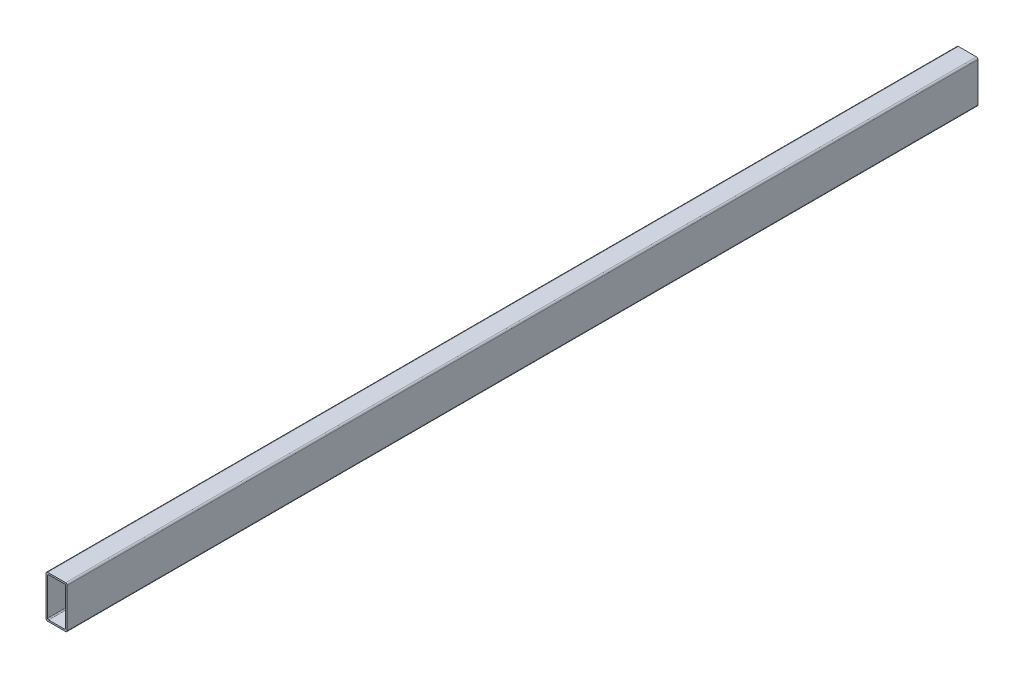
ISO-10303-21;
HEADER;
FILE_DESCRIPTION(('STEP AP214'),'2;1');
FILE_NAME('part.step','',(''),(''),'','','');
FILE_SCHEMA(('AUTOMOTIVE_DESIGN { 1 0 10303 214 1 1 1 1 }'));
ENDSEC;
DATA;
#1=APPLICATION_CONTEXT('core data for automotive mechanical design processes');
#2=APPLICATION_PROTOCOL_DEFINITION('international standard','automotive_design',2000,#1);
#3=PRODUCT_CONTEXT('',#1,'mechanical');
#4=PRODUCT('Part','Part','',(#3));
#5=PRODUCT_RELATED_PRODUCT_CATEGORY('part','',(#4));
#6=PRODUCT_DEFINITION_FORMATION('','',#4);
#7=PRODUCT_DEFINITION_CONTEXT('part definition',#1,'design');
#8=PRODUCT_DEFINITION('design','',#6,#7);
#9=PRODUCT_DEFINITION_SHAPE('','',#8);
#10=(LENGTH_UNIT() NAMED_UNIT(*) SI_UNIT(.MILLI.,.METRE.));
#11=(NAMED_UNIT(*) PLANE_ANGLE_UNIT() SI_UNIT($,.RADIAN.));
#12=(NAMED_UNIT(*) SI_UNIT($,.STERADIAN.) SOLID_ANGLE_UNIT());
#13=UNCERTAINTY_MEASURE_WITH_UNIT(LENGTH_MEASURE(1.E-05),#10,'distance_accuracy_value','');
#14=(GEOMETRIC_REPRESENTATION_CONTEXT(3) GLOBAL_UNCERTAINTY_ASSIGNED_CONTEXT((#13)) GLOBAL_UNIT_ASSIGNED_CONTEXT((#10,
#11,#12)) REPRESENTATION_CONTEXT('',''));
#15=CARTESIAN_POINT('',(0.,0.,0.));
#16=DIRECTION('',(0.,0.,1.));
#17=DIRECTION('',(1.,0.,0.));
#18=AXIS2_PLACEMENT_3D('',#15,#16,#17);
#19=CARTESIAN_POINT('',(0.,38.4999999999987,474.721359549994));
#20=DIRECTION('',(-1.,0.,0.));
#21=DIRECTION('',(0.,-1.,0.));
#22=AXIS2_PLACEMENT_3D('',#19,#20,#21);
#23=PLANE('',#22);
#24=DIRECTION('',(0.,1.,0.));
#25=VECTOR('',#24,1.);
#26=CARTESIAN_POINT('',(0.,38.4999999999987,429.999999999998));
#27=LINE('',#26,#25);
#28=CARTESIAN_POINT('',(0.,1.49999999999872,429.999999999998));
#29=VERTEX_POINT('',#28);
#30=CARTESIAN_POINT('',(0.,38.4999999999987,429.999999999998));
#31=VERTEX_POINT('',#30);
#32=EDGE_CURVE('E196',#29,#31,#27,.T.);
#33=ORIENTED_EDGE('',*,*,#32,.F.);
#34=DIRECTION('',(0.,0.,-1.));
#35=VECTOR('',#34,1.);
#36=CARTESIAN_POINT('',(0.,1.49999999999872,474.721359549994));
#37=LINE('',#36,#35);
#38=CARTESIAN_POINT('',(0.,1.49999999999872,-429.999999999998));
#39=VERTEX_POINT('',#38);
#40=EDGE_CURVE('E49',#29,#39,#37,.T.);
#41=ORIENTED_EDGE('',*,*,#40,.T.);
#42=DIRECTION('',(0.,1.,0.));
#43=VECTOR('',#42,1.);
#44=CARTESIAN_POINT('',(0.,38.4999999999987,-429.999999999998));
#45=LINE('',#44,#43);
#46=CARTESIAN_POINT('',(0.,38.4999999999987,-429.999999999998));
#47=VERTEX_POINT('',#46);
#48=EDGE_CURVE('E272',#39,#47,#45,.T.);
#49=ORIENTED_EDGE('',*,*,#48,.T.);
#50=DIRECTION('',(0.,0.,-1.));
#51=VECTOR('',#50,1.);
#52=CARTESIAN_POINT('',(0.,38.4999999999987,474.721359549994));
#53=LINE('',#52,#51);
#54=EDGE_CURVE('E232',#31,#47,#53,.T.);
#55=ORIENTED_EDGE('',*,*,#54,.F.);
#56=EDGE_LOOP('',(#33,#41,#49,#55));
#57=FACE_BOUND('',#56,.T.);
#58=ADVANCED_FACE('F34',(#57),#23,.F.);
#59=CARTESIAN_POINT('',(-1.50000000000001,1.49999999999872,474.721359549994));
#60=DIRECTION('',(0.,0.,-1.));
#61=DIRECTION('',(-1.,0.,0.));
#62=AXIS2_PLACEMENT_3D('',#59,#60,#61);
#63=CYLINDRICAL_SURFACE('',#62,1.5);
#64=CARTESIAN_POINT('',(-1.50000000000001,1.49999999999872,429.999999999998));
#65=DIRECTION('',(0.,0.,1.));
#66=DIRECTION('',(1.,0.,0.));
#67=AXIS2_PLACEMENT_3D('',#64,#65,#66);
#68=CIRCLE('',#67,1.5);
#69=CARTESIAN_POINT('',(-1.50000000000003,-1.27675647831893E-12,429.999999999998));
#70=VERTEX_POINT('',#69);
#71=EDGE_CURVE('E199',#70,#29,#68,.T.);
#72=ORIENTED_EDGE('',*,*,#71,.F.);
#73=DIRECTION('',(0.,0.,-1.));
#74=VECTOR('',#73,1.);
#75=CARTESIAN_POINT('',(-1.50000000000003,-1.27675647831893E-12,474.721359549994));
#76=LINE('',#75,#74);
#77=CARTESIAN_POINT('',(-1.50000000000003,-1.27675647831893E-12,-429.999999999998));
#78=VERTEX_POINT('',#77);
#79=EDGE_CURVE('E235',#70,#78,#76,.T.);
#80=ORIENTED_EDGE('',*,*,#79,.T.);
#81=CARTESIAN_POINT('',(-1.50000000000001,1.49999999999872,-429.999999999998));
#82=DIRECTION('',(0.,0.,1.));
#83=DIRECTION('',(1.,0.,0.));
#84=AXIS2_PLACEMENT_3D('',#81,#82,#83);
#85=CIRCLE('',#84,1.5);
#86=EDGE_CURVE('E270',#78,#39,#85,.T.);
#87=ORIENTED_EDGE('',*,*,#86,.T.);
#88=ORIENTED_EDGE('',*,*,#40,.F.);
#89=EDGE_LOOP('',(#72,#80,#87,#88));
#90=FACE_BOUND('',#89,.T.);
#91=ADVANCED_FACE('F320',(#90),#63,.T.);
#92=CARTESIAN_POINT('',(-18.5,-1.27675647831893E-12,474.721359549994));
#93=DIRECTION('',(0.,1.,0.));
#94=DIRECTION('',(0.,0.,1.));
#95=AXIS2_PLACEMENT_3D('',#92,#93,#94);
#96=PLANE('',#95);
#97=DIRECTION('',(1.,0.,0.));
#98=VECTOR('',#97,1.);
#99=CARTESIAN_POINT('',(-18.5,-1.27675647831893E-12,429.999999999998));
#100=LINE('',#99,#98);
#101=CARTESIAN_POINT('',(-18.5,-1.27675647831893E-12,429.999999999998));
#102=VERTEX_POINT('',#101);
#103=EDGE_CURVE('E202',#102,#70,#100,.T.);
#104=ORIENTED_EDGE('',*,*,#103,.F.);
#105=DIRECTION('',(0.,0.,-1.));
#106=VECTOR('',#105,1.);
#107=CARTESIAN_POINT('',(-18.5,-1.27675647831893E-12,474.721359549994));
#108=LINE('',#107,#106);
#109=CARTESIAN_POINT('',(-18.5,-1.27675647831893E-12,-429.999999999998));
#110=VERTEX_POINT('',#109);
#111=EDGE_CURVE('E237',#102,#110,#108,.T.);
#112=ORIENTED_EDGE('',*,*,#111,.T.);
#113=DIRECTION('',(1.,0.,0.));
#114=VECTOR('',#113,1.);
#115=CARTESIAN_POINT('',(-18.5,-1.27675647831893E-12,-429.999999999998));
#116=LINE('',#115,#114);
#117=EDGE_CURVE('E267',#110,#78,#116,.T.);
#118=ORIENTED_EDGE('',*,*,#117,.T.);
#119=ORIENTED_EDGE('',*,*,#79,.F.);
#120=EDGE_LOOP('',(#104,#112,#118,#119));
#121=FACE_BOUND('',#120,.T.);
#122=ADVANCED_FACE('F325',(#121),#96,.F.);
#123=CARTESIAN_POINT('',(-18.5,1.49999999999872,474.721359549994));
#124=DIRECTION('',(0.,0.,-1.));
#125=DIRECTION('',(-1.,0.,0.));
#126=AXIS2_PLACEMENT_3D('',#123,#124,#125);
#127=CYLINDRICAL_SURFACE('',#126,1.5);
#128=CARTESIAN_POINT('',(-18.5,1.49999999999872,429.999999999998));
#129=DIRECTION('',(0.,0.,1.));
#130=DIRECTION('',(1.,0.,0.));
#131=AXIS2_PLACEMENT_3D('',#128,#129,#130);
#132=CIRCLE('',#131,1.5);
#133=CARTESIAN_POINT('',(-20.,1.49999999999872,429.999999999998));
#134=VERTEX_POINT('',#133);
#135=EDGE_CURVE('E205',#134,#102,#132,.T.);
#136=ORIENTED_EDGE('',*,*,#135,.F.);
#137=DIRECTION('',(0.,0.,-1.));
#138=VECTOR('',#137,1.);
#139=CARTESIAN_POINT('',(-20.,1.49999999999872,474.721359549994));
#140=LINE('',#139,#138);
#141=CARTESIAN_POINT('',(-20.,1.49999999999872,-429.999999999998));
#142=VERTEX_POINT('',#141);
#143=EDGE_CURVE('E239',#134,#142,#140,.T.);
#144=ORIENTED_EDGE('',*,*,#143,.T.);
#145=CARTESIAN_POINT('',(-18.5,1.49999999999872,-429.999999999998));
#146=DIRECTION('',(0.,0.,1.));
#147=DIRECTION('',(1.,0.,0.));
#148=AXIS2_PLACEMENT_3D('',#145,#146,#147);
#149=CIRCLE('',#148,1.5);
#150=EDGE_CURVE('E264',#142,#110,#149,.T.);
#151=ORIENTED_EDGE('',*,*,#150,.T.);
#152=ORIENTED_EDGE('',*,*,#111,.F.);
#153=EDGE_LOOP('',(#136,#144,#151,#152));
#154=FACE_BOUND('',#153,.T.);
#155=ADVANCED_FACE('F330',(#154),#127,.T.);
#156=CARTESIAN_POINT('',(-20.,38.4999999999987,474.721359549994));
#157=DIRECTION('',(1.,0.,0.));
#158=DIRECTION('',(0.,1.,0.));
#159=AXIS2_PLACEMENT_3D('',#156,#157,#158);
#160=PLANE('',#159);
#161=DIRECTION('',(0.,-1.,0.));
#162=VECTOR('',#161,1.);
#163=CARTESIAN_POINT('',(-20.,38.4999999999987,429.999999999998));
#164=LINE('',#163,#162);
#165=CARTESIAN_POINT('',(-20.,38.4999999999987,429.999999999998));
#166=VERTEX_POINT('',#165);
#167=EDGE_CURVE('E208',#166,#134,#164,.T.);
#168=ORIENTED_EDGE('',*,*,#167,.F.);
#169=DIRECTION('',(0.,0.,-1.));
#170=VECTOR('',#169,1.);
#171=CARTESIAN_POINT('',(-20.,38.4999999999987,474.721359549994));
#172=LINE('',#171,#170);
#173=CARTESIAN_POINT('',(-20.,38.4999999999987,-429.999999999998));
#174=VERTEX_POINT('',#173);
#175=EDGE_CURVE('E241',#166,#174,#172,.T.);
#176=ORIENTED_EDGE('',*,*,#175,.T.);
#177=DIRECTION('',(0.,-1.,0.));
#178=VECTOR('',#177,1.);
#179=CARTESIAN_POINT('',(-20.,38.4999999999987,-429.999999999998));
#180=LINE('',#179,#178);
#181=EDGE_CURVE('E259',#174,#142,#180,.T.);
#182=ORIENTED_EDGE('',*,*,#181,.T.);
#183=ORIENTED_EDGE('',*,*,#143,.F.);
#184=EDGE_LOOP('',(#168,#176,#182,#183));
#185=FACE_BOUND('',#184,.T.);
#186=ADVANCED_FACE('F334',(#185),#160,.F.);
#187=CARTESIAN_POINT('',(-18.5,38.4999999999987,474.721359549994));
#188=DIRECTION('',(0.,0.,-1.));
#189=DIRECTION('',(-1.,0.,0.));
#190=AXIS2_PLACEMENT_3D('',#187,#188,#189);
#191=CYLINDRICAL_SURFACE('',#190,1.50000000000001);
#192=CARTESIAN_POINT('',(-18.5,38.4999999999987,429.999999999998));
#193=DIRECTION('',(0.,0.,1.));
#194=DIRECTION('',(1.,0.,0.));
#195=AXIS2_PLACEMENT_3D('',#192,#193,#194);
#196=CIRCLE('',#195,1.50000000000001);
#197=CARTESIAN_POINT('',(-18.5,39.9999999999987,429.999999999998));
#198=VERTEX_POINT('',#197);
#199=EDGE_CURVE('E211',#198,#166,#196,.T.);
#200=ORIENTED_EDGE('',*,*,#199,.F.);
#201=DIRECTION('',(0.,0.,-1.));
#202=VECTOR('',#201,1.);
#203=CARTESIAN_POINT('',(-18.5,39.9999999999987,474.721359549994));
#204=LINE('',#203,#202);
#205=CARTESIAN_POINT('',(-18.5,39.9999999999987,-429.999999999998));
#206=VERTEX_POINT('',#205);
#207=EDGE_CURVE('E243',#198,#206,#204,.T.);
#208=ORIENTED_EDGE('',*,*,#207,.T.);
#209=CARTESIAN_POINT('',(-18.5,38.4999999999987,-429.999999999998));
#210=DIRECTION('',(0.,0.,1.));
#211=DIRECTION('',(1.,0.,0.));
#212=AXIS2_PLACEMENT_3D('',#209,#210,#211);
#213=CIRCLE('',#212,1.50000000000001);
#214=EDGE_CURVE('E258',#206,#174,#213,.T.);
#215=ORIENTED_EDGE('',*,*,#214,.T.);
#216=ORIENTED_EDGE('',*,*,#175,.F.);
#217=EDGE_LOOP('',(#200,#208,#215,#216));
#218=FACE_BOUND('',#217,.T.);
#219=ADVANCED_FACE('F338',(#218),#191,.T.);
#220=CARTESIAN_POINT('',(-18.5,39.9999999999987,474.721359549994));
#221=DIRECTION('',(0.,-1.,0.));
#222=DIRECTION('',(0.,0.,-1.));
#223=AXIS2_PLACEMENT_3D('',#220,#221,#222);
#224=PLANE('',#223);
#225=DIRECTION('',(-1.,0.,0.));
#226=VECTOR('',#225,1.);
#227=CARTESIAN_POINT('',(-18.5,39.9999999999987,429.999999999998));
#228=LINE('',#227,#226);
#229=CARTESIAN_POINT('',(-1.50000000000003,39.9999999999987,429.999999999998));
#230=VERTEX_POINT('',#229);
#231=EDGE_CURVE('E214',#230,#198,#228,.T.);
#232=ORIENTED_EDGE('',*,*,#231,.F.);
#233=DIRECTION('',(0.,0.,-1.));
#234=VECTOR('',#233,1.);
#235=CARTESIAN_POINT('',(-1.50000000000003,39.9999999999987,474.721359549994));
#236=LINE('',#235,#234);
#237=CARTESIAN_POINT('',(-1.50000000000003,39.9999999999987,-429.999999999998));
#238=VERTEX_POINT('',#237);
#239=EDGE_CURVE('E42',#230,#238,#236,.T.);
#240=ORIENTED_EDGE('',*,*,#239,.T.);
#241=DIRECTION('',(-1.,0.,0.));
#242=VECTOR('',#241,1.);
#243=CARTESIAN_POINT('',(-18.5,39.9999999999987,-429.999999999998));
#244=LINE('',#243,#242);
#245=EDGE_CURVE('E177',#238,#206,#244,.T.);
#246=ORIENTED_EDGE('',*,*,#245,.T.);
#247=ORIENTED_EDGE('',*,*,#207,.F.);
#248=EDGE_LOOP('',(#232,#240,#246,#247));
#249=FACE_BOUND('',#248,.T.);
#250=ADVANCED_FACE('F247',(#249),#224,.F.);
#251=CARTESIAN_POINT('',(-1.50000000000001,38.4999999999987,474.721359549994));
#252=DIRECTION('',(0.,0.,-1.));
#253=DIRECTION('',(-1.,0.,0.));
#254=AXIS2_PLACEMENT_3D('',#251,#252,#253);
#255=CYLINDRICAL_SURFACE('',#254,1.5);
#256=CARTESIAN_POINT('',(-1.50000000000001,38.4999999999987,429.999999999998));
#257=DIRECTION('',(0.,0.,1.));
#258=DIRECTION('',(1.,0.,0.));
#259=AXIS2_PLACEMENT_3D('',#256,#257,#258);
#260=CIRCLE('',#259,1.5);
#261=EDGE_CURVE('E217',#31,#230,#260,.T.);
#262=ORIENTED_EDGE('',*,*,#261,.F.);
#263=ORIENTED_EDGE('',*,*,#54,.T.);
#264=CARTESIAN_POINT('',(-1.50000000000001,38.4999999999987,-429.999999999998));
#265=DIRECTION('',(0.,0.,1.));
#266=DIRECTION('',(1.,0.,0.));
#267=AXIS2_PLACEMENT_3D('',#264,#265,#266);
#268=CIRCLE('',#267,1.5);
#269=EDGE_CURVE('E172',#47,#238,#268,.T.);
#270=ORIENTED_EDGE('',*,*,#269,.T.);
#271=ORIENTED_EDGE('',*,*,#239,.F.);
#272=EDGE_LOOP('',(#262,#263,#270,#271));
#273=FACE_BOUND('',#272,.T.);
#274=ADVANCED_FACE('F36',(#273),#255,.T.);
#275=CARTESIAN_POINT('',(-17.5,1.49999999999872,474.721359549994));
#276=DIRECTION('',(0.,1.,0.));
#277=DIRECTION('',(-1.,0.,0.));
#278=AXIS2_PLACEMENT_3D('',#275,#276,#277);
#279=PLANE('',#278);
#280=DIRECTION('',(0.,0.,-1.));
#281=VECTOR('',#280,1.);
#282=CARTESIAN_POINT('',(-17.5,1.49999999999873,474.721359549994));
#283=LINE('',#282,#281);
#284=CARTESIAN_POINT('',(-17.5,1.49999999999872,429.999999999998));
#285=VERTEX_POINT('',#284);
#286=CARTESIAN_POINT('',(-17.5,1.49999999999872,-429.999999999998));
#287=VERTEX_POINT('',#286);
#288=EDGE_CURVE('E148',#285,#287,#283,.T.);
#289=ORIENTED_EDGE('',*,*,#288,.F.);
#290=DIRECTION('',(1.,0.,0.));
#291=VECTOR('',#290,1.);
#292=CARTESIAN_POINT('',(-17.5,1.49999999999872,429.999999999998));
#293=LINE('',#292,#291);
#294=CARTESIAN_POINT('',(-2.50000000000001,1.49999999999874,429.999999999998));
#295=VERTEX_POINT('',#294);
#296=EDGE_CURVE('E11',#285,#295,#293,.T.);
#297=ORIENTED_EDGE('',*,*,#296,.T.);
#298=DIRECTION('',(0.,0.,-1.));
#299=VECTOR('',#298,1.);
#300=CARTESIAN_POINT('',(-2.50000000000001,1.49999999999874,474.721359549994));
#301=LINE('',#300,#299);
#302=CARTESIAN_POINT('',(-2.50000000000001,1.49999999999874,-429.999999999998));
#303=VERTEX_POINT('',#302);
#304=EDGE_CURVE('E157',#295,#303,#301,.T.);
#305=ORIENTED_EDGE('',*,*,#304,.T.);
#306=DIRECTION('',(1.,0.,0.));
#307=VECTOR('',#306,1.);
#308=CARTESIAN_POINT('',(-17.5,1.49999999999872,-429.999999999998));
#309=LINE('',#308,#307);
#310=EDGE_CURVE('E165',#287,#303,#309,.T.);
#311=ORIENTED_EDGE('',*,*,#310,.F.);
#312=EDGE_LOOP('',(#289,#297,#305,#311));
#313=FACE_BOUND('',#312,.T.);
#314=ADVANCED_FACE('F170',(#313),#279,.T.);
#315=CARTESIAN_POINT('',(-17.5,2.49999999999873,474.721359549994));
#316=DIRECTION('',(0.,0.,-1.));
#317=DIRECTION('',(-1.,0.,0.));
#318=AXIS2_PLACEMENT_3D('',#315,#316,#317);
#319=CYLINDRICAL_SURFACE('',#318,0.999999999999997);
#320=DIRECTION('',(0.,0.,-1.));
#321=VECTOR('',#320,1.);
#322=CARTESIAN_POINT('',(-18.5,2.49999999999873,474.721359549994));
#323=LINE('',#322,#321);
#324=CARTESIAN_POINT('',(-18.5,2.49999999999873,429.999999999998));
#325=VERTEX_POINT('',#324);
#326=CARTESIAN_POINT('',(-18.5,2.49999999999873,-429.999999999998));
#327=VERTEX_POINT('',#326);
#328=EDGE_CURVE('E156',#325,#327,#323,.T.);
#329=ORIENTED_EDGE('',*,*,#328,.F.);
#330=CARTESIAN_POINT('',(-17.5,2.49999999999873,429.999999999998));
#331=DIRECTION('',(0.,0.,1.));
#332=DIRECTION('',(1.,0.,0.));
#333=AXIS2_PLACEMENT_3D('',#330,#331,#332);
#334=CIRCLE('',#333,0.999999999999997);
#335=EDGE_CURVE('E153',#325,#285,#334,.T.);
#336=ORIENTED_EDGE('',*,*,#335,.T.);
#337=ORIENTED_EDGE('',*,*,#288,.T.);
#338=CARTESIAN_POINT('',(-17.5,2.49999999999873,-429.999999999998));
#339=DIRECTION('',(0.,0.,1.));
#340=DIRECTION('',(1.,0.,0.));
#341=AXIS2_PLACEMENT_3D('',#338,#339,#340);
#342=CIRCLE('',#341,0.999999999999997);
#343=EDGE_CURVE('E152',#327,#287,#342,.T.);
#344=ORIENTED_EDGE('',*,*,#343,.F.);
#345=EDGE_LOOP('',(#329,#336,#337,#344));
#346=FACE_BOUND('',#345,.T.);
#347=ADVANCED_FACE('F151',(#346),#319,.F.);
#348=CARTESIAN_POINT('',(-18.5,37.4999999999987,474.721359549994));
#349=DIRECTION('',(1.,0.,0.));
#350=DIRECTION('',(0.,1.,0.));
#351=AXIS2_PLACEMENT_3D('',#348,#349,#350);
#352=PLANE('',#351);
#353=DIRECTION('',(0.,0.,-1.));
#354=VECTOR('',#353,1.);
#355=CARTESIAN_POINT('',(-18.5,37.4999999999987,474.721359549994));
#356=LINE('',#355,#354);
#357=CARTESIAN_POINT('',(-18.5,37.4999999999987,429.999999999998));
#358=VERTEX_POINT('',#357);
#359=CARTESIAN_POINT('',(-18.5,37.4999999999987,-429.999999999998));
#360=VERTEX_POINT('',#359);
#361=EDGE_CURVE('E222',#358,#360,#356,.T.);
#362=ORIENTED_EDGE('',*,*,#361,.F.);
#363=DIRECTION('',(0.,-1.,0.));
#364=VECTOR('',#363,1.);
#365=CARTESIAN_POINT('',(-18.5,37.4999999999987,429.999999999998));
#366=LINE('',#365,#364);
#367=EDGE_CURVE('E174',#358,#325,#366,.T.);
#368=ORIENTED_EDGE('',*,*,#367,.T.);
#369=ORIENTED_EDGE('',*,*,#328,.T.);
#370=DIRECTION('',(0.,-1.,0.));
#371=VECTOR('',#370,1.);
#372=CARTESIAN_POINT('',(-18.5,37.4999999999987,-429.999999999998));
#373=LINE('',#372,#371);
#374=EDGE_CURVE('E168',#360,#327,#373,.T.);
#375=ORIENTED_EDGE('',*,*,#374,.F.);
#376=EDGE_LOOP('',(#362,#368,#369,#375));
#377=FACE_BOUND('',#376,.T.);
#378=ADVANCED_FACE('F293',(#377),#352,.T.);
#379=CARTESIAN_POINT('',(-17.5,37.4999999999987,474.721359549994));
#380=DIRECTION('',(0.,0.,-1.));
#381=DIRECTION('',(-1.,0.,0.));
#382=AXIS2_PLACEMENT_3D('',#379,#380,#381);
#383=CYLINDRICAL_SURFACE('',#382,1.);
#384=DIRECTION('',(0.,0.,-1.));
#385=VECTOR('',#384,1.);
#386=CARTESIAN_POINT('',(-17.5,38.4999999999987,474.721359549994));
#387=LINE('',#386,#385);
#388=CARTESIAN_POINT('',(-17.5,38.4999999999987,429.999999999998));
#389=VERTEX_POINT('',#388);
#390=CARTESIAN_POINT('',(-17.5,38.4999999999987,-429.999999999998));
#391=VERTEX_POINT('',#390);
#392=EDGE_CURVE('E224',#389,#391,#387,.T.);
#393=ORIENTED_EDGE('',*,*,#392,.F.);
#394=CARTESIAN_POINT('',(-17.5,37.4999999999987,429.999999999998));
#395=DIRECTION('',(0.,0.,1.));
#396=DIRECTION('',(1.,0.,0.));
#397=AXIS2_PLACEMENT_3D('',#394,#395,#396);
#398=CIRCLE('',#397,1.);
#399=EDGE_CURVE('E183',#389,#358,#398,.T.);
#400=ORIENTED_EDGE('',*,*,#399,.T.);
#401=ORIENTED_EDGE('',*,*,#361,.T.);
#402=CARTESIAN_POINT('',(-17.5,37.4999999999987,-429.999999999998));
#403=DIRECTION('',(0.,0.,1.));
#404=DIRECTION('',(1.,0.,0.));
#405=AXIS2_PLACEMENT_3D('',#402,#403,#404);
#406=CIRCLE('',#405,1.);
#407=EDGE_CURVE('E285',#391,#360,#406,.T.);
#408=ORIENTED_EDGE('',*,*,#407,.F.);
#409=EDGE_LOOP('',(#393,#400,#401,#408));
#410=FACE_BOUND('',#409,.T.);
#411=ADVANCED_FACE('F297',(#410),#383,.F.);
#412=CARTESIAN_POINT('',(-17.5,38.4999999999987,474.721359549994));
#413=DIRECTION('',(0.,-1.,0.));
#414=DIRECTION('',(1.,0.,0.));
#415=AXIS2_PLACEMENT_3D('',#412,#413,#414);
#416=PLANE('',#415);
#417=DIRECTION('',(0.,0.,-1.));
#418=VECTOR('',#417,1.);
#419=CARTESIAN_POINT('',(-2.50000000000001,38.4999999999987,474.721359549994));
#420=LINE('',#419,#418);
#421=CARTESIAN_POINT('',(-2.50000000000001,38.4999999999987,429.999999999998));
#422=VERTEX_POINT('',#421);
#423=CARTESIAN_POINT('',(-2.50000000000001,38.4999999999987,-429.999999999998));
#424=VERTEX_POINT('',#423);
#425=EDGE_CURVE('E226',#422,#424,#420,.T.);
#426=ORIENTED_EDGE('',*,*,#425,.F.);
#427=DIRECTION('',(-1.,0.,0.));
#428=VECTOR('',#427,1.);
#429=CARTESIAN_POINT('',(-17.5,38.4999999999987,429.999999999998));
#430=LINE('',#429,#428);
#431=EDGE_CURVE('E186',#422,#389,#430,.T.);
#432=ORIENTED_EDGE('',*,*,#431,.T.);
#433=ORIENTED_EDGE('',*,*,#392,.T.);
#434=DIRECTION('',(-1.,0.,0.));
#435=VECTOR('',#434,1.);
#436=CARTESIAN_POINT('',(-17.5,38.4999999999987,-429.999999999998));
#437=LINE('',#436,#435);
#438=EDGE_CURVE('E282',#424,#391,#437,.T.);
#439=ORIENTED_EDGE('',*,*,#438,.F.);
#440=EDGE_LOOP('',(#426,#432,#433,#439));
#441=FACE_BOUND('',#440,.T.);
#442=ADVANCED_FACE('F299',(#441),#416,.T.);
#443=CARTESIAN_POINT('',(-2.50000000000001,37.4999999999987,474.721359549994));
#444=DIRECTION('',(0.,0.,-1.));
#445=DIRECTION('',(-1.,0.,0.));
#446=AXIS2_PLACEMENT_3D('',#443,#444,#445);
#447=CYLINDRICAL_SURFACE('',#446,1.);
#448=DIRECTION('',(0.,0.,-1.));
#449=VECTOR('',#448,1.);
#450=CARTESIAN_POINT('',(-1.50000000000001,37.4999999999987,474.721359549994));
#451=LINE('',#450,#449);
#452=CARTESIAN_POINT('',(-1.50000000000001,37.4999999999987,429.999999999998));
#453=VERTEX_POINT('',#452);
#454=CARTESIAN_POINT('',(-1.50000000000001,37.4999999999987,-429.999999999998));
#455=VERTEX_POINT('',#454);
#456=EDGE_CURVE('E228',#453,#455,#451,.T.);
#457=ORIENTED_EDGE('',*,*,#456,.F.);
#458=CARTESIAN_POINT('',(-2.50000000000001,37.4999999999987,429.999999999998));
#459=DIRECTION('',(0.,0.,1.));
#460=DIRECTION('',(1.,0.,0.));
#461=AXIS2_PLACEMENT_3D('',#458,#459,#460);
#462=CIRCLE('',#461,1.);
#463=EDGE_CURVE('E189',#453,#422,#462,.T.);
#464=ORIENTED_EDGE('',*,*,#463,.T.);
#465=ORIENTED_EDGE('',*,*,#425,.T.);
#466=CARTESIAN_POINT('',(-2.50000000000001,37.4999999999987,-429.999999999998));
#467=DIRECTION('',(0.,0.,1.));
#468=DIRECTION('',(1.,0.,0.));
#469=AXIS2_PLACEMENT_3D('',#466,#467,#468);
#470=CIRCLE('',#469,1.);
#471=EDGE_CURVE('E279',#455,#424,#470,.T.);
#472=ORIENTED_EDGE('',*,*,#471,.F.);
#473=EDGE_LOOP('',(#457,#464,#465,#472));
#474=FACE_BOUND('',#473,.T.);
#475=ADVANCED_FACE('F303',(#474),#447,.F.);
#476=CARTESIAN_POINT('',(-1.50000000000001,37.4999999999987,474.721359549994));
#477=DIRECTION('',(-1.,0.,0.));
#478=DIRECTION('',(0.,-1.,0.));
#479=AXIS2_PLACEMENT_3D('',#476,#477,#478);
#480=PLANE('',#479);
#481=DIRECTION('',(0.,0.,-1.));
#482=VECTOR('',#481,1.);
#483=CARTESIAN_POINT('',(-1.50000000000001,2.49999999999873,474.721359549994));
#484=LINE('',#483,#482);
#485=CARTESIAN_POINT('',(-1.50000000000001,2.49999999999873,429.999999999998));
#486=VERTEX_POINT('',#485);
#487=CARTESIAN_POINT('',(-1.50000000000001,2.49999999999873,-429.999999999998));
#488=VERTEX_POINT('',#487);
#489=EDGE_CURVE('E230',#486,#488,#484,.T.);
#490=ORIENTED_EDGE('',*,*,#489,.F.);
#491=DIRECTION('',(0.,1.,0.));
#492=VECTOR('',#491,1.);
#493=CARTESIAN_POINT('',(-1.50000000000001,37.4999999999987,429.999999999998));
#494=LINE('',#493,#492);
#495=EDGE_CURVE('E192',#486,#453,#494,.T.);
#496=ORIENTED_EDGE('',*,*,#495,.T.);
#497=ORIENTED_EDGE('',*,*,#456,.T.);
#498=DIRECTION('',(0.,1.,0.));
#499=VECTOR('',#498,1.);
#500=CARTESIAN_POINT('',(-1.50000000000001,37.4999999999987,-429.999999999998));
#501=LINE('',#500,#499);
#502=EDGE_CURVE('E276',#488,#455,#501,.T.);
#503=ORIENTED_EDGE('',*,*,#502,.F.);
#504=EDGE_LOOP('',(#490,#496,#497,#503));
#505=FACE_BOUND('',#504,.T.);
#506=ADVANCED_FACE('F307',(#505),#480,.T.);
#507=CARTESIAN_POINT('',(-2.50000000000001,2.49999999999873,474.721359549994));
#508=DIRECTION('',(0.,0.,-1.));
#509=DIRECTION('',(-1.,0.,0.));
#510=AXIS2_PLACEMENT_3D('',#507,#508,#509);
#511=CYLINDRICAL_SURFACE('',#510,0.999999999999994);
#512=ORIENTED_EDGE('',*,*,#304,.F.);
#513=CARTESIAN_POINT('',(-2.50000000000001,2.49999999999873,429.999999999998));
#514=DIRECTION('',(0.,0.,1.));
#515=DIRECTION('',(1.,0.,0.));
#516=AXIS2_PLACEMENT_3D('',#513,#514,#515);
#517=CIRCLE('',#516,0.999999999999994);
#518=EDGE_CURVE('E57',#295,#486,#517,.T.);
#519=ORIENTED_EDGE('',*,*,#518,.T.);
#520=ORIENTED_EDGE('',*,*,#489,.T.);
#521=CARTESIAN_POINT('',(-2.50000000000001,2.49999999999873,-429.999999999998));
#522=DIRECTION('',(0.,0.,1.));
#523=DIRECTION('',(1.,0.,0.));
#524=AXIS2_PLACEMENT_3D('',#521,#522,#523);
#525=CIRCLE('',#524,0.999999999999994);
#526=EDGE_CURVE('E274',#303,#488,#525,.T.);
#527=ORIENTED_EDGE('',*,*,#526,.F.);
#528=EDGE_LOOP('',(#512,#519,#520,#527));
#529=FACE_BOUND('',#528,.T.);
#530=ADVANCED_FACE('F309',(#529),#511,.F.);
#531=CARTESIAN_POINT('',(1550.00000000001,38.4999999999989,429.999999999999));
#532=DIRECTION('',(0.,0.,1.));
#533=DIRECTION('',(0.,1.,0.));
#534=AXIS2_PLACEMENT_3D('',#531,#532,#533);
#535=PLANE('',#534);
#536=ORIENTED_EDGE('',*,*,#518,.F.);
#537=ORIENTED_EDGE('',*,*,#296,.F.);
#538=ORIENTED_EDGE('',*,*,#335,.F.);
#539=ORIENTED_EDGE('',*,*,#367,.F.);
#540=ORIENTED_EDGE('',*,*,#399,.F.);
#541=ORIENTED_EDGE('',*,*,#431,.F.);
#542=ORIENTED_EDGE('',*,*,#463,.F.);
#543=ORIENTED_EDGE('',*,*,#495,.F.);
#544=EDGE_LOOP('',(#536,#537,#538,#539,#540,#541,#542,#543));
#545=FACE_BOUND('',#544,.T.);
#546=ORIENTED_EDGE('',*,*,#32,.T.);
#547=ORIENTED_EDGE('',*,*,#261,.T.);
#548=ORIENTED_EDGE('',*,*,#231,.T.);
#549=ORIENTED_EDGE('',*,*,#199,.T.);
#550=ORIENTED_EDGE('',*,*,#167,.T.);
#551=ORIENTED_EDGE('',*,*,#135,.T.);
#552=ORIENTED_EDGE('',*,*,#103,.T.);
#553=ORIENTED_EDGE('',*,*,#71,.T.);
#554=EDGE_LOOP('',(#546,#547,#548,#549,#550,#551,#552,#553));
#555=FACE_BOUND('',#554,.T.);
#556=ADVANCED_FACE('F294',(#545,#555),#535,.T.);
#557=CARTESIAN_POINT('',(1550.00000000001,38.4999999999989,-429.999999999999));
#558=DIRECTION('',(0.,0.,-1.));
#559=DIRECTION('',(0.,1.,0.));
#560=AXIS2_PLACEMENT_3D('',#557,#558,#559);
#561=PLANE('',#560);
#562=ORIENTED_EDGE('',*,*,#526,.T.);
#563=ORIENTED_EDGE('',*,*,#502,.T.);
#564=ORIENTED_EDGE('',*,*,#471,.T.);
#565=ORIENTED_EDGE('',*,*,#438,.T.);
#566=ORIENTED_EDGE('',*,*,#407,.T.);
#567=ORIENTED_EDGE('',*,*,#374,.T.);
#568=ORIENTED_EDGE('',*,*,#343,.T.);
#569=ORIENTED_EDGE('',*,*,#310,.T.);
#570=EDGE_LOOP('',(#562,#563,#564,#565,#566,#567,#568,#569));
#571=FACE_BOUND('',#570,.T.);
#572=ORIENTED_EDGE('',*,*,#48,.F.);
#573=ORIENTED_EDGE('',*,*,#86,.F.);
#574=ORIENTED_EDGE('',*,*,#117,.F.);
#575=ORIENTED_EDGE('',*,*,#150,.F.);
#576=ORIENTED_EDGE('',*,*,#181,.F.);
#577=ORIENTED_EDGE('',*,*,#214,.F.);
#578=ORIENTED_EDGE('',*,*,#245,.F.);
#579=ORIENTED_EDGE('',*,*,#269,.F.);
#580=EDGE_LOOP('',(#572,#573,#574,#575,#576,#577,#578,#579));
#581=FACE_BOUND('',#580,.T.);
#582=ADVANCED_FACE('F163',(#571,#581),#561,.T.);
#583=CLOSED_SHELL('',(#58,#91,#122,#155,#186,#219,#250,#274,#314,#347,#378,#411,#442,#475,#506,
#530,#556,#582));
#584=MANIFOLD_SOLID_BREP('B2',#583);
#585=ADVANCED_BREP_SHAPE_REPRESENTATION('',(#18,#584),#14);
#586=SHAPE_DEFINITION_REPRESENTATION(#9,#585);
ENDSEC;
END-ISO-10303-21;
